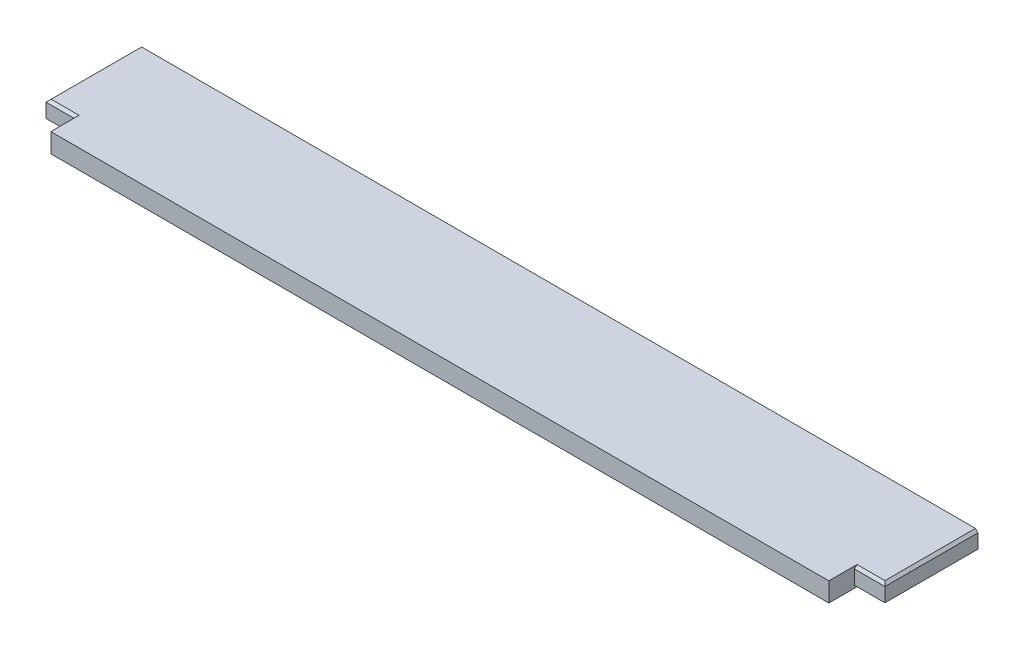
ISO-10303-21;
HEADER;
FILE_DESCRIPTION(('STEP AP214'),'2;1');
FILE_NAME('part.step','',(''),(''),'','','');
FILE_SCHEMA(('AUTOMOTIVE_DESIGN { 1 0 10303 214 1 1 1 1 }'));
ENDSEC;
DATA;
#1=APPLICATION_CONTEXT('core data for automotive mechanical design processes');
#2=APPLICATION_PROTOCOL_DEFINITION('international standard','automotive_design',2000,#1);
#3=PRODUCT_CONTEXT('',#1,'mechanical');
#4=PRODUCT('Part','Part','',(#3));
#5=PRODUCT_RELATED_PRODUCT_CATEGORY('part','',(#4));
#6=PRODUCT_DEFINITION_FORMATION('','',#4);
#7=PRODUCT_DEFINITION_CONTEXT('part definition',#1,'design');
#8=PRODUCT_DEFINITION('design','',#6,#7);
#9=PRODUCT_DEFINITION_SHAPE('','',#8);
#10=(LENGTH_UNIT() NAMED_UNIT(*) SI_UNIT(.MILLI.,.METRE.));
#11=(NAMED_UNIT(*) PLANE_ANGLE_UNIT() SI_UNIT($,.RADIAN.));
#12=(NAMED_UNIT(*) SI_UNIT($,.STERADIAN.) SOLID_ANGLE_UNIT());
#13=UNCERTAINTY_MEASURE_WITH_UNIT(LENGTH_MEASURE(1.E-05),#10,'distance_accuracy_value','');
#14=(GEOMETRIC_REPRESENTATION_CONTEXT(3) GLOBAL_UNCERTAINTY_ASSIGNED_CONTEXT((#13)) GLOBAL_UNIT_ASSIGNED_CONTEXT((#10,
#11,#12)) REPRESENTATION_CONTEXT('',''));
#15=CARTESIAN_POINT('',(0.,0.,0.));
#16=DIRECTION('',(0.,0.,1.));
#17=DIRECTION('',(1.,0.,0.));
#18=AXIS2_PLACEMENT_3D('',#15,#16,#17);
#19=CARTESIAN_POINT('',(830.2752,19.05,-25.3999999999999));
#20=DIRECTION('',(-1.,0.,0.));
#21=DIRECTION('',(0.,0.,1.));
#22=AXIS2_PLACEMENT_3D('',#19,#20,#21);
#23=PLANE('',#22);
#24=DIRECTION('',(0.,-1.,0.));
#25=VECTOR('',#24,1.);
#26=CARTESIAN_POINT('',(830.2752,19.05,-25.3999999999999));
#27=LINE('',#26,#25);
#28=CARTESIAN_POINT('',(830.2752,16.5099999999999,-25.3999999999999));
#29=VERTEX_POINT('',#28);
#30=CARTESIAN_POINT('',(830.2752,2.53999999999988,-25.3999999999999));
#31=VERTEX_POINT('',#30);
#32=EDGE_CURVE('E167',#29,#31,#27,.T.);
#33=ORIENTED_EDGE('',*,*,#32,.T.);
#34=DIRECTION('',(0.,0.,-1.));
#35=VECTOR('',#34,1.);
#36=CARTESIAN_POINT('',(830.2752,2.53999999999988,-117.475));
#37=LINE('',#36,#35);
#38=CARTESIAN_POINT('',(830.2752,2.53999999999988,-117.475));
#39=VERTEX_POINT('',#38);
#40=EDGE_CURVE('E199',#31,#39,#37,.T.);
#41=ORIENTED_EDGE('',*,*,#40,.T.);
#42=DIRECTION('',(0.,-1.,0.));
#43=VECTOR('',#42,1.);
#44=CARTESIAN_POINT('',(830.2752,19.05,-117.475));
#45=LINE('',#44,#43);
#46=CARTESIAN_POINT('',(830.2752,16.5099999999999,-117.475));
#47=VERTEX_POINT('',#46);
#48=EDGE_CURVE('E194',#47,#39,#45,.T.);
#49=ORIENTED_EDGE('',*,*,#48,.F.);
#50=DIRECTION('',(0.,0.,1.));
#51=VECTOR('',#50,1.);
#52=CARTESIAN_POINT('',(830.2752,16.5099999999999,-25.3999999999999));
#53=LINE('',#52,#51);
#54=EDGE_CURVE('E197',#47,#29,#53,.T.);
#55=ORIENTED_EDGE('',*,*,#54,.T.);
#56=EDGE_LOOP('',(#33,#41,#49,#55));
#57=FACE_BOUND('',#56,.T.);
#58=ADVANCED_FACE('F41',(#57),#23,.F.);
#59=CARTESIAN_POINT('',(0.,19.05,-117.475));
#60=DIRECTION('',(0.,0.,1.));
#61=DIRECTION('',(1.,0.,0.));
#62=AXIS2_PLACEMENT_3D('',#59,#60,#61);
#63=PLANE('',#62);
#64=ORIENTED_EDGE('',*,*,#48,.T.);
#65=DIRECTION('',(-0.707106781186563,-0.707106781186532,0.));
#66=VECTOR('',#65,1.);
#67=CARTESIAN_POINT('',(830.2752,2.53999999999988,-117.475));
#68=LINE('',#67,#66);
#69=CARTESIAN_POINT('',(827.7352,0.,-117.475));
#70=VERTEX_POINT('',#69);
#71=EDGE_CURVE('E208',#39,#70,#68,.T.);
#72=ORIENTED_EDGE('',*,*,#71,.T.);
#73=DIRECTION('',(-1.,0.,0.));
#74=VECTOR('',#73,1.);
#75=CARTESIAN_POINT('',(0.,0.,-117.475));
#76=LINE('',#75,#74);
#77=CARTESIAN_POINT('',(2.53999999999999,0.,-117.475));
#78=VERTEX_POINT('',#77);
#79=EDGE_CURVE('E171',#70,#78,#76,.T.);
#80=ORIENTED_EDGE('',*,*,#79,.T.);
#81=DIRECTION('',(-0.707106781186563,0.707106781186532,0.));
#82=VECTOR('',#81,1.);
#83=CARTESIAN_POINT('',(0.,2.53999999999988,-117.475));
#84=LINE('',#83,#82);
#85=CARTESIAN_POINT('',(0.,2.53999999999988,-117.475));
#86=VERTEX_POINT('',#85);
#87=EDGE_CURVE('E206',#78,#86,#84,.T.);
#88=ORIENTED_EDGE('',*,*,#87,.T.);
#89=DIRECTION('',(0.,-1.,0.));
#90=VECTOR('',#89,1.);
#91=CARTESIAN_POINT('',(0.,19.05,-117.475));
#92=LINE('',#91,#90);
#93=CARTESIAN_POINT('',(0.,16.51,-117.475));
#94=VERTEX_POINT('',#93);
#95=EDGE_CURVE('E191',#94,#86,#92,.T.);
#96=ORIENTED_EDGE('',*,*,#95,.F.);
#97=DIRECTION('',(-0.707106781186532,-0.707106781186563,0.));
#98=VECTOR('',#97,1.);
#99=CARTESIAN_POINT('',(2.53999999999987,19.05,-117.475));
#100=LINE('',#99,#98);
#101=CARTESIAN_POINT('',(2.53999999999987,19.05,-117.475));
#102=VERTEX_POINT('',#101);
#103=EDGE_CURVE('E202',#94,#102,#100,.F.);
#104=ORIENTED_EDGE('',*,*,#103,.T.);
#105=DIRECTION('',(-1.,0.,0.));
#106=VECTOR('',#105,1.);
#107=CARTESIAN_POINT('',(0.,19.05,-117.475));
#108=LINE('',#107,#106);
#109=CARTESIAN_POINT('',(827.7352,19.05,-117.475));
#110=VERTEX_POINT('',#109);
#111=EDGE_CURVE('E152',#110,#102,#108,.T.);
#112=ORIENTED_EDGE('',*,*,#111,.F.);
#113=DIRECTION('',(-0.707106781186548,0.707106781186548,0.));
#114=VECTOR('',#113,1.);
#115=CARTESIAN_POINT('',(827.7352,19.05,-117.475));
#116=LINE('',#115,#114);
#117=EDGE_CURVE('E204',#110,#47,#116,.F.);
#118=ORIENTED_EDGE('',*,*,#117,.T.);
#119=EDGE_LOOP('',(#64,#72,#80,#88,#96,#104,#112,#118));
#120=FACE_BOUND('',#119,.T.);
#121=ADVANCED_FACE('F267',(#120),#63,.F.);
#122=CARTESIAN_POINT('',(0.,19.05,-25.4));
#123=DIRECTION('',(1.,0.,0.));
#124=DIRECTION('',(0.,0.,-1.));
#125=AXIS2_PLACEMENT_3D('',#122,#123,#124);
#126=PLANE('',#125);
#127=ORIENTED_EDGE('',*,*,#95,.T.);
#128=DIRECTION('',(0.,0.,1.));
#129=VECTOR('',#128,1.);
#130=CARTESIAN_POINT('',(0.,2.53999999999988,-25.4));
#131=LINE('',#130,#129);
#132=CARTESIAN_POINT('',(0.,2.53999999999988,-25.4));
#133=VERTEX_POINT('',#132);
#134=EDGE_CURVE('E230',#86,#133,#131,.T.);
#135=ORIENTED_EDGE('',*,*,#134,.T.);
#136=DIRECTION('',(0.,-1.,0.));
#137=VECTOR('',#136,1.);
#138=CARTESIAN_POINT('',(0.,19.05,-25.4));
#139=LINE('',#138,#137);
#140=CARTESIAN_POINT('',(0.,16.51,-25.4));
#141=VERTEX_POINT('',#140);
#142=EDGE_CURVE('E188',#141,#133,#139,.T.);
#143=ORIENTED_EDGE('',*,*,#142,.F.);
#144=DIRECTION('',(0.,0.,-1.));
#145=VECTOR('',#144,1.);
#146=CARTESIAN_POINT('',(0.,16.51,-25.4));
#147=LINE('',#146,#145);
#148=EDGE_CURVE('E228',#141,#94,#147,.T.);
#149=ORIENTED_EDGE('',*,*,#148,.T.);
#150=EDGE_LOOP('',(#127,#135,#143,#149));
#151=FACE_BOUND('',#150,.T.);
#152=ADVANCED_FACE('F264',(#151),#126,.F.);
#153=CARTESIAN_POINT('',(0.,19.05,-25.4));
#154=DIRECTION('',(0.,0.,-1.));
#155=DIRECTION('',(-1.,0.,0.));
#156=AXIS2_PLACEMENT_3D('',#153,#154,#155);
#157=PLANE('',#156);
#158=ORIENTED_EDGE('',*,*,#142,.T.);
#159=DIRECTION('',(1.,0.,0.));
#160=VECTOR('',#159,1.);
#161=CARTESIAN_POINT('',(30.1625,2.53999999999988,-25.4));
#162=LINE('',#161,#160);
#163=CARTESIAN_POINT('',(30.1625,2.53999999999988,-25.4));
#164=VERTEX_POINT('',#163);
#165=EDGE_CURVE('E225',#133,#164,#162,.T.);
#166=ORIENTED_EDGE('',*,*,#165,.T.);
#167=DIRECTION('',(0.,-1.,0.));
#168=VECTOR('',#167,1.);
#169=CARTESIAN_POINT('',(30.1625,19.05,-25.4));
#170=LINE('',#169,#168);
#171=CARTESIAN_POINT('',(30.1625,16.51,-25.4));
#172=VERTEX_POINT('',#171);
#173=EDGE_CURVE('E161',#172,#164,#170,.T.);
#174=ORIENTED_EDGE('',*,*,#173,.F.);
#175=DIRECTION('',(-1.,0.,0.));
#176=VECTOR('',#175,1.);
#177=CARTESIAN_POINT('',(0.,16.51,-25.4));
#178=LINE('',#177,#176);
#179=EDGE_CURVE('E223',#172,#141,#178,.T.);
#180=ORIENTED_EDGE('',*,*,#179,.T.);
#181=EDGE_LOOP('',(#158,#166,#174,#180));
#182=FACE_BOUND('',#181,.T.);
#183=ADVANCED_FACE('F278',(#182),#157,.F.);
#184=CARTESIAN_POINT('',(30.1625,19.05,0.));
#185=DIRECTION('',(1.,0.,0.));
#186=DIRECTION('',(0.,0.,-1.));
#187=AXIS2_PLACEMENT_3D('',#184,#185,#186);
#188=PLANE('',#187);
#189=DIRECTION('',(0.,0.,1.));
#190=VECTOR('',#189,1.);
#191=CARTESIAN_POINT('',(30.1625,0.,0.));
#192=LINE('',#191,#190);
#193=CARTESIAN_POINT('',(30.1625,0.,-27.94));
#194=VERTEX_POINT('',#193);
#195=CARTESIAN_POINT('',(30.1625,0.,0.));
#196=VERTEX_POINT('',#195);
#197=EDGE_CURVE('E158',#194,#196,#192,.T.);
#198=ORIENTED_EDGE('',*,*,#197,.T.);
#199=DIRECTION('',(0.,-1.,0.));
#200=VECTOR('',#199,1.);
#201=CARTESIAN_POINT('',(30.1625,19.05,0.));
#202=LINE('',#201,#200);
#203=CARTESIAN_POINT('',(30.1625,19.05,0.));
#204=VERTEX_POINT('',#203);
#205=EDGE_CURVE('E155',#204,#196,#202,.T.);
#206=ORIENTED_EDGE('',*,*,#205,.F.);
#207=DIRECTION('',(0.,0.,1.));
#208=VECTOR('',#207,1.);
#209=CARTESIAN_POINT('',(30.1625,19.05,0.));
#210=LINE('',#209,#208);
#211=CARTESIAN_POINT('',(30.1625,19.05,-27.9399999999999));
#212=VERTEX_POINT('',#211);
#213=EDGE_CURVE('E142',#212,#204,#210,.T.);
#214=ORIENTED_EDGE('',*,*,#213,.F.);
#215=DIRECTION('',(0.,0.707106781186563,-0.707106781186532));
#216=VECTOR('',#215,1.);
#217=CARTESIAN_POINT('',(30.1625,5.08000000000006,-13.9700000000005));
#218=LINE('',#217,#216);
#219=EDGE_CURVE('E11',#212,#172,#218,.F.);
#220=ORIENTED_EDGE('',*,*,#219,.T.);
#221=ORIENTED_EDGE('',*,*,#173,.T.);
#222=DIRECTION('',(0.,-0.707106781186532,-0.707106781186563));
#223=VECTOR('',#222,1.);
#224=CARTESIAN_POINT('',(30.1625,23.4949999999996,-4.44499999999938));
#225=LINE('',#224,#223);
#226=EDGE_CURVE('E240',#164,#194,#225,.T.);
#227=ORIENTED_EDGE('',*,*,#226,.T.);
#228=EDGE_LOOP('',(#198,#206,#214,#220,#221,#227));
#229=FACE_BOUND('',#228,.T.);
#230=ADVANCED_FACE('F156',(#229),#188,.F.);
#231=CARTESIAN_POINT('',(30.1625,19.05,0.));
#232=DIRECTION('',(0.,0.,-1.));
#233=DIRECTION('',(-1.,0.,0.));
#234=AXIS2_PLACEMENT_3D('',#231,#232,#233);
#235=PLANE('',#234);
#236=DIRECTION('',(1.,0.,0.));
#237=VECTOR('',#236,1.);
#238=CARTESIAN_POINT('',(30.1625,0.,0.));
#239=LINE('',#238,#237);
#240=CARTESIAN_POINT('',(800.1127,0.,0.));
#241=VERTEX_POINT('',#240);
#242=EDGE_CURVE('E176',#196,#241,#239,.T.);
#243=ORIENTED_EDGE('',*,*,#242,.T.);
#244=DIRECTION('',(0.,-1.,0.));
#245=VECTOR('',#244,1.);
#246=CARTESIAN_POINT('',(800.1127,19.05,0.));
#247=LINE('',#246,#245);
#248=CARTESIAN_POINT('',(800.1127,19.05,0.));
#249=VERTEX_POINT('',#248);
#250=EDGE_CURVE('E162',#249,#241,#247,.T.);
#251=ORIENTED_EDGE('',*,*,#250,.F.);
#252=DIRECTION('',(1.,0.,0.));
#253=VECTOR('',#252,1.);
#254=CARTESIAN_POINT('',(30.1625,19.05,0.));
#255=LINE('',#254,#253);
#256=EDGE_CURVE('E146',#204,#249,#255,.T.);
#257=ORIENTED_EDGE('',*,*,#256,.F.);
#258=ORIENTED_EDGE('',*,*,#205,.T.);
#259=EDGE_LOOP('',(#243,#251,#257,#258));
#260=FACE_BOUND('',#259,.T.);
#261=ADVANCED_FACE('F164',(#260),#235,.F.);
#262=CARTESIAN_POINT('',(800.1127,19.05,0.));
#263=DIRECTION('',(-1.,0.,0.));
#264=DIRECTION('',(0.,0.,1.));
#265=AXIS2_PLACEMENT_3D('',#262,#263,#264);
#266=PLANE('',#265);
#267=DIRECTION('',(0.,0.,-1.));
#268=VECTOR('',#267,1.);
#269=CARTESIAN_POINT('',(800.1127,0.,0.));
#270=LINE('',#269,#268);
#271=CARTESIAN_POINT('',(800.1127,0.,-27.9399999999999));
#272=VERTEX_POINT('',#271);
#273=EDGE_CURVE('E178',#241,#272,#270,.T.);
#274=ORIENTED_EDGE('',*,*,#273,.T.);
#275=DIRECTION('',(0.,0.707106781186532,0.707106781186563));
#276=VECTOR('',#275,1.);
#277=CARTESIAN_POINT('',(800.1127,23.4949999999995,-4.44499999999935));
#278=LINE('',#277,#276);
#279=CARTESIAN_POINT('',(800.1127,2.53999999999988,-25.3999999999999));
#280=VERTEX_POINT('',#279);
#281=EDGE_CURVE('E238',#272,#280,#278,.T.);
#282=ORIENTED_EDGE('',*,*,#281,.T.);
#283=DIRECTION('',(0.,-1.,0.));
#284=VECTOR('',#283,1.);
#285=CARTESIAN_POINT('',(800.1127,19.05,-25.3999999999999));
#286=LINE('',#285,#284);
#287=CARTESIAN_POINT('',(800.1127,16.5099999999999,-25.3999999999999));
#288=VERTEX_POINT('',#287);
#289=EDGE_CURVE('E182',#288,#280,#286,.T.);
#290=ORIENTED_EDGE('',*,*,#289,.F.);
#291=DIRECTION('',(0.,-0.707106781186548,0.707106781186547));
#292=VECTOR('',#291,1.);
#293=CARTESIAN_POINT('',(800.1127,5.07999999999999,-13.97));
#294=LINE('',#293,#292);
#295=CARTESIAN_POINT('',(800.1127,19.05,-27.94));
#296=VERTEX_POINT('',#295);
#297=EDGE_CURVE('E51',#288,#296,#294,.F.);
#298=ORIENTED_EDGE('',*,*,#297,.T.);
#299=DIRECTION('',(0.,0.,-1.));
#300=VECTOR('',#299,1.);
#301=CARTESIAN_POINT('',(800.1127,19.05,0.));
#302=LINE('',#301,#300);
#303=EDGE_CURVE('E64',#249,#296,#302,.T.);
#304=ORIENTED_EDGE('',*,*,#303,.F.);
#305=ORIENTED_EDGE('',*,*,#250,.T.);
#306=EDGE_LOOP('',(#274,#282,#290,#298,#304,#305));
#307=FACE_BOUND('',#306,.T.);
#308=ADVANCED_FACE('F287',(#307),#266,.F.);
#309=CARTESIAN_POINT('',(830.2752,19.05,-25.3999999999999));
#310=DIRECTION('',(0.,0.,-1.));
#311=DIRECTION('',(-1.,0.,0.));
#312=AXIS2_PLACEMENT_3D('',#309,#310,#311);
#313=PLANE('',#312);
#314=ORIENTED_EDGE('',*,*,#289,.T.);
#315=DIRECTION('',(1.,0.,0.));
#316=VECTOR('',#315,1.);
#317=CARTESIAN_POINT('',(830.2752,2.53999999999988,-25.3999999999999));
#318=LINE('',#317,#316);
#319=EDGE_CURVE('E221',#280,#31,#318,.T.);
#320=ORIENTED_EDGE('',*,*,#319,.T.);
#321=ORIENTED_EDGE('',*,*,#32,.F.);
#322=DIRECTION('',(-1.,0.,0.));
#323=VECTOR('',#322,1.);
#324=CARTESIAN_POINT('',(830.2752,16.5099999999999,-25.3999999999999));
#325=LINE('',#324,#323);
#326=EDGE_CURVE('E219',#29,#288,#325,.T.);
#327=ORIENTED_EDGE('',*,*,#326,.T.);
#328=EDGE_LOOP('',(#314,#320,#321,#327));
#329=FACE_BOUND('',#328,.T.);
#330=ADVANCED_FACE('F308',(#329),#313,.F.);
#331=CARTESIAN_POINT('',(0.,19.05,0.));
#332=DIRECTION('',(0.,-1.,0.));
#333=DIRECTION('',(0.,0.,-1.));
#334=AXIS2_PLACEMENT_3D('',#331,#332,#333);
#335=PLANE('',#334);
#336=DIRECTION('',(1.,0.,0.));
#337=VECTOR('',#336,1.);
#338=CARTESIAN_POINT('',(0.,19.05,-27.9399999999999));
#339=LINE('',#338,#337);
#340=CARTESIAN_POINT('',(827.7352,19.05,-27.94));
#341=VERTEX_POINT('',#340);
#342=EDGE_CURVE('E59',#296,#341,#339,.T.);
#343=ORIENTED_EDGE('',*,*,#342,.T.);
#344=DIRECTION('',(0.,0.,-1.));
#345=VECTOR('',#344,1.);
#346=CARTESIAN_POINT('',(827.7352,19.05,0.));
#347=LINE('',#346,#345);
#348=EDGE_CURVE('E236',#341,#110,#347,.T.);
#349=ORIENTED_EDGE('',*,*,#348,.T.);
#350=ORIENTED_EDGE('',*,*,#111,.T.);
#351=DIRECTION('',(0.,0.,1.));
#352=VECTOR('',#351,1.);
#353=CARTESIAN_POINT('',(2.53999999999987,19.05,0.));
#354=LINE('',#353,#352);
#355=CARTESIAN_POINT('',(2.53999999999987,19.05,-27.9399999999999));
#356=VERTEX_POINT('',#355);
#357=EDGE_CURVE('E232',#102,#356,#354,.T.);
#358=ORIENTED_EDGE('',*,*,#357,.T.);
#359=DIRECTION('',(1.,0.,0.));
#360=VECTOR('',#359,1.);
#361=CARTESIAN_POINT('',(0.,19.05,-27.9399999999999));
#362=LINE('',#361,#360);
#363=EDGE_CURVE('E149',#356,#212,#362,.T.);
#364=ORIENTED_EDGE('',*,*,#363,.T.);
#365=ORIENTED_EDGE('',*,*,#213,.T.);
#366=ORIENTED_EDGE('',*,*,#256,.T.);
#367=ORIENTED_EDGE('',*,*,#303,.T.);
#368=EDGE_LOOP('',(#343,#349,#350,#358,#364,#365,#366,#367));
#369=FACE_BOUND('',#368,.T.);
#370=ADVANCED_FACE('F144',(#369),#335,.F.);
#371=CARTESIAN_POINT('',(0.,0.,0.));
#372=DIRECTION('',(0.,-1.,0.));
#373=DIRECTION('',(0.,0.,-1.));
#374=AXIS2_PLACEMENT_3D('',#371,#372,#373);
#375=PLANE('',#374);
#376=ORIENTED_EDGE('',*,*,#79,.F.);
#377=DIRECTION('',(0.,0.,1.));
#378=VECTOR('',#377,1.);
#379=CARTESIAN_POINT('',(827.7352,0.,-25.3999999999999));
#380=LINE('',#379,#378);
#381=CARTESIAN_POINT('',(827.7352,0.,-27.9399999999999));
#382=VERTEX_POINT('',#381);
#383=EDGE_CURVE('E217',#70,#382,#380,.T.);
#384=ORIENTED_EDGE('',*,*,#383,.T.);
#385=DIRECTION('',(-1.,0.,0.));
#386=VECTOR('',#385,1.);
#387=CARTESIAN_POINT('',(800.1127,0.,-27.9399999999999));
#388=LINE('',#387,#386);
#389=EDGE_CURVE('E214',#382,#272,#388,.T.);
#390=ORIENTED_EDGE('',*,*,#389,.T.);
#391=ORIENTED_EDGE('',*,*,#273,.F.);
#392=ORIENTED_EDGE('',*,*,#242,.F.);
#393=ORIENTED_EDGE('',*,*,#197,.F.);
#394=DIRECTION('',(-1.,0.,0.));
#395=VECTOR('',#394,1.);
#396=CARTESIAN_POINT('',(0.,0.,-27.94));
#397=LINE('',#396,#395);
#398=CARTESIAN_POINT('',(2.53999999999999,0.,-27.94));
#399=VERTEX_POINT('',#398);
#400=EDGE_CURVE('E212',#194,#399,#397,.T.);
#401=ORIENTED_EDGE('',*,*,#400,.T.);
#402=DIRECTION('',(0.,0.,-1.));
#403=VECTOR('',#402,1.);
#404=CARTESIAN_POINT('',(2.53999999999999,0.,-117.475));
#405=LINE('',#404,#403);
#406=EDGE_CURVE('E210',#399,#78,#405,.T.);
#407=ORIENTED_EDGE('',*,*,#406,.T.);
#408=EDGE_LOOP('',(#376,#384,#390,#391,#392,#393,#401,#407));
#409=FACE_BOUND('',#408,.T.);
#410=ADVANCED_FACE('F284',(#409),#375,.T.);
#411=CARTESIAN_POINT('',(830.2752,2.53999999999988,-25.3999999999999));
#412=DIRECTION('',(0.,-0.707106781186563,0.707106781186532));
#413=DIRECTION('',(-1.,0.,0.));
#414=AXIS2_PLACEMENT_3D('',#411,#412,#413);
#415=PLANE('',#414);
#416=ORIENTED_EDGE('',*,*,#281,.F.);
#417=ORIENTED_EDGE('',*,*,#389,.F.);
#418=DIRECTION('',(0.577350269189634,0.577350269189609,0.577350269189634));
#419=VECTOR('',#418,1.);
#420=CARTESIAN_POINT('',(830.2752,2.53999999999988,-25.3999999999999));
#421=LINE('',#420,#419);
#422=EDGE_CURVE('E174',#31,#382,#421,.F.);
#423=ORIENTED_EDGE('',*,*,#422,.F.);
#424=ORIENTED_EDGE('',*,*,#319,.F.);
#425=EDGE_LOOP('',(#416,#417,#423,#424));
#426=FACE_BOUND('',#425,.T.);
#427=ADVANCED_FACE('F305',(#426),#415,.T.);
#428=CARTESIAN_POINT('',(830.2752,2.53999999999988,-25.3999999999999));
#429=DIRECTION('',(0.707106781186532,-0.707106781186563,0.));
#430=DIRECTION('',(0.,0.,1.));
#431=AXIS2_PLACEMENT_3D('',#428,#429,#430);
#432=PLANE('',#431);
#433=ORIENTED_EDGE('',*,*,#422,.T.);
#434=ORIENTED_EDGE('',*,*,#383,.F.);
#435=ORIENTED_EDGE('',*,*,#71,.F.);
#436=ORIENTED_EDGE('',*,*,#40,.F.);
#437=EDGE_LOOP('',(#433,#434,#435,#436));
#438=FACE_BOUND('',#437,.T.);
#439=ADVANCED_FACE('F300',(#438),#432,.T.);
#440=CARTESIAN_POINT('',(0.,2.53999999999988,-25.4));
#441=DIRECTION('',(-0.707106781186532,-0.707106781186563,0.));
#442=DIRECTION('',(0.,0.,-1.));
#443=AXIS2_PLACEMENT_3D('',#440,#441,#442);
#444=PLANE('',#443);
#445=ORIENTED_EDGE('',*,*,#87,.F.);
#446=ORIENTED_EDGE('',*,*,#406,.F.);
#447=DIRECTION('',(-0.577350269189634,0.577350269189609,0.577350269189634));
#448=VECTOR('',#447,1.);
#449=CARTESIAN_POINT('',(0.,2.53999999999988,-25.4));
#450=LINE('',#449,#448);
#451=EDGE_CURVE('E245',#133,#399,#450,.F.);
#452=ORIENTED_EDGE('',*,*,#451,.F.);
#453=ORIENTED_EDGE('',*,*,#134,.F.);
#454=EDGE_LOOP('',(#445,#446,#452,#453));
#455=FACE_BOUND('',#454,.T.);
#456=ADVANCED_FACE('F274',(#455),#444,.T.);
#457=CARTESIAN_POINT('',(0.,2.53999999999988,-25.4));
#458=DIRECTION('',(0.,-0.707106781186563,0.707106781186532));
#459=DIRECTION('',(-1.,0.,0.));
#460=AXIS2_PLACEMENT_3D('',#457,#458,#459);
#461=PLANE('',#460);
#462=ORIENTED_EDGE('',*,*,#451,.T.);
#463=ORIENTED_EDGE('',*,*,#400,.F.);
#464=ORIENTED_EDGE('',*,*,#226,.F.);
#465=ORIENTED_EDGE('',*,*,#165,.F.);
#466=EDGE_LOOP('',(#462,#463,#464,#465));
#467=FACE_BOUND('',#466,.T.);
#468=ADVANCED_FACE('F282',(#467),#461,.T.);
#469=CARTESIAN_POINT('',(0.,19.05,-27.9399999999999));
#470=DIRECTION('',(0.,-0.707106781186547,-0.707106781186548));
#471=DIRECTION('',(1.,0.,0.));
#472=AXIS2_PLACEMENT_3D('',#469,#470,#471);
#473=PLANE('',#472);
#474=ORIENTED_EDGE('',*,*,#297,.F.);
#475=ORIENTED_EDGE('',*,*,#326,.F.);
#476=DIRECTION('',(-0.577350269189626,0.577350269189626,-0.577350269189626));
#477=VECTOR('',#476,1.);
#478=CARTESIAN_POINT('',(551.823466666666,294.961733333333,-303.851733333333));
#479=LINE('',#478,#477);
#480=EDGE_CURVE('E247',#341,#29,#479,.F.);
#481=ORIENTED_EDGE('',*,*,#480,.F.);
#482=ORIENTED_EDGE('',*,*,#342,.F.);
#483=EDGE_LOOP('',(#474,#475,#481,#482));
#484=FACE_BOUND('',#483,.T.);
#485=ADVANCED_FACE('F292',(#484),#473,.F.);
#486=CARTESIAN_POINT('',(827.7352,19.05,0.));
#487=DIRECTION('',(-0.707106781186548,-0.707106781186548,0.));
#488=DIRECTION('',(0.,0.,-1.));
#489=AXIS2_PLACEMENT_3D('',#486,#487,#488);
#490=PLANE('',#489);
#491=ORIENTED_EDGE('',*,*,#480,.T.);
#492=ORIENTED_EDGE('',*,*,#54,.F.);
#493=ORIENTED_EDGE('',*,*,#117,.F.);
#494=ORIENTED_EDGE('',*,*,#348,.F.);
#495=EDGE_LOOP('',(#491,#492,#493,#494));
#496=FACE_BOUND('',#495,.T.);
#497=ADVANCED_FACE('F293',(#496),#490,.F.);
#498=CARTESIAN_POINT('',(2.53999999999987,19.05,0.));
#499=DIRECTION('',(0.707106781186563,-0.707106781186532,0.));
#500=DIRECTION('',(0.,0.,1.));
#501=AXIS2_PLACEMENT_3D('',#498,#499,#500);
#502=PLANE('',#501);
#503=ORIENTED_EDGE('',*,*,#103,.F.);
#504=ORIENTED_EDGE('',*,*,#148,.F.);
#505=DIRECTION('',(0.577350269189617,0.577350269189643,-0.577350269189617));
#506=VECTOR('',#505,1.);
#507=CARTESIAN_POINT('',(-6.77333333333314,9.73666666666657,-18.6266666666668));
#508=LINE('',#507,#506);
#509=EDGE_CURVE('E46',#356,#141,#508,.F.);
#510=ORIENTED_EDGE('',*,*,#509,.F.);
#511=ORIENTED_EDGE('',*,*,#357,.F.);
#512=EDGE_LOOP('',(#503,#504,#510,#511));
#513=FACE_BOUND('',#512,.T.);
#514=ADVANCED_FACE('F44',(#513),#502,.F.);
#515=CARTESIAN_POINT('',(0.,19.05,-27.9399999999999));
#516=DIRECTION('',(0.,-0.707106781186532,-0.707106781186563));
#517=DIRECTION('',(1.,0.,0.));
#518=AXIS2_PLACEMENT_3D('',#515,#516,#517);
#519=PLANE('',#518);
#520=ORIENTED_EDGE('',*,*,#509,.T.);
#521=ORIENTED_EDGE('',*,*,#179,.F.);
#522=ORIENTED_EDGE('',*,*,#219,.F.);
#523=ORIENTED_EDGE('',*,*,#363,.F.);
#524=EDGE_LOOP('',(#520,#521,#522,#523));
#525=FACE_BOUND('',#524,.T.);
#526=ADVANCED_FACE('F256',(#525),#519,.F.);
#527=CLOSED_SHELL('',(#58,#121,#152,#183,#230,#261,#308,#330,#370,#410,#427,#439,#456,#468,#485,
#497,#514,#526));
#528=MANIFOLD_SOLID_BREP('B2',#527);
#529=ADVANCED_BREP_SHAPE_REPRESENTATION('',(#18,#528),#14);
#530=SHAPE_DEFINITION_REPRESENTATION(#9,#529);
ENDSEC;
END-ISO-10303-21;
